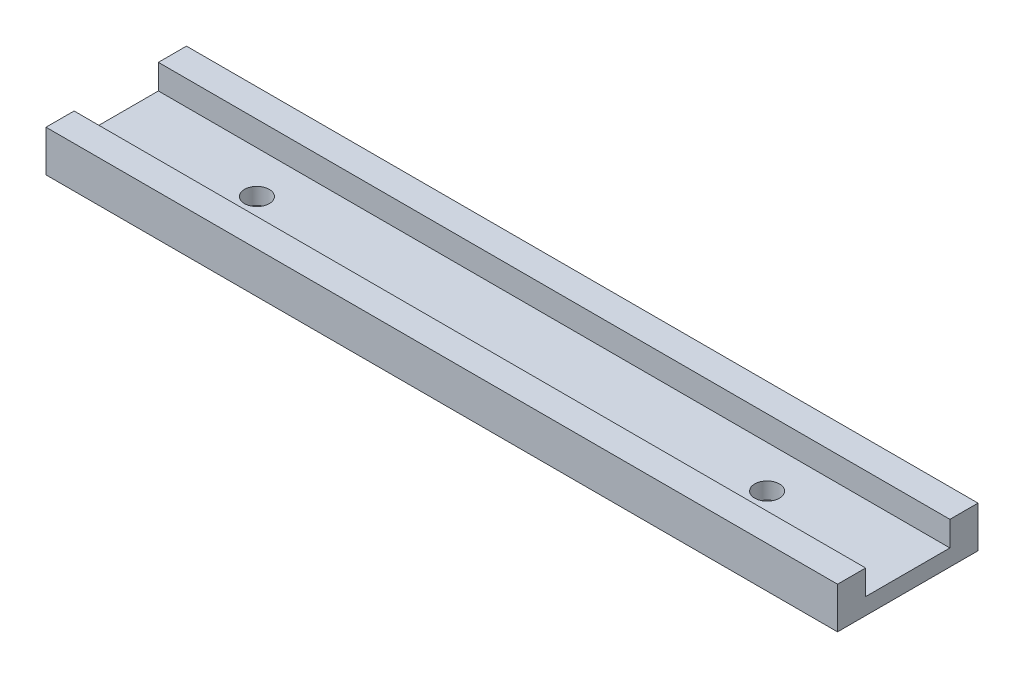
ISO-10303-21;
HEADER;
FILE_DESCRIPTION(('STEP AP214'),'2;1');
FILE_NAME('part.step','',(''),(''),'','','');
FILE_SCHEMA(('AUTOMOTIVE_DESIGN { 1 0 10303 214 1 1 1 1 }'));
ENDSEC;
DATA;
#1=APPLICATION_CONTEXT('core data for automotive mechanical design processes');
#2=APPLICATION_PROTOCOL_DEFINITION('international standard','automotive_design',2000,#1);
#3=PRODUCT_CONTEXT('',#1,'mechanical');
#4=PRODUCT('Part','Part','',(#3));
#5=PRODUCT_RELATED_PRODUCT_CATEGORY('part','',(#4));
#6=PRODUCT_DEFINITION_FORMATION('','',#4);
#7=PRODUCT_DEFINITION_CONTEXT('part definition',#1,'design');
#8=PRODUCT_DEFINITION('design','',#6,#7);
#9=PRODUCT_DEFINITION_SHAPE('','',#8);
#10=(LENGTH_UNIT() NAMED_UNIT(*) SI_UNIT(.MILLI.,.METRE.));
#11=(NAMED_UNIT(*) PLANE_ANGLE_UNIT() SI_UNIT($,.RADIAN.));
#12=(NAMED_UNIT(*) SI_UNIT($,.STERADIAN.) SOLID_ANGLE_UNIT());
#13=UNCERTAINTY_MEASURE_WITH_UNIT(LENGTH_MEASURE(1.E-05),#10,'distance_accuracy_value','');
#14=(GEOMETRIC_REPRESENTATION_CONTEXT(3) GLOBAL_UNCERTAINTY_ASSIGNED_CONTEXT((#13)) GLOBAL_UNIT_ASSIGNED_CONTEXT((#10,
#11,#12)) REPRESENTATION_CONTEXT('',''));
#15=CARTESIAN_POINT('',(0.,0.,0.));
#16=DIRECTION('',(0.,0.,1.));
#17=DIRECTION('',(1.,0.,0.));
#18=AXIS2_PLACEMENT_3D('',#15,#16,#17);
#19=CARTESIAN_POINT('',(47.9,5.,5.1));
#20=DIRECTION('',(0.,-1.,0.));
#21=DIRECTION('',(0.,0.,-1.));
#22=AXIS2_PLACEMENT_3D('',#19,#20,#21);
#23=PLANE('',#22);
#24=DIRECTION('',(0.,0.,1.));
#25=VECTOR('',#24,1.);
#26=CARTESIAN_POINT('',(-47.9,5.,5.1));
#27=LINE('',#26,#25);
#28=CARTESIAN_POINT('',(-47.9,5.,5.1));
#29=VERTEX_POINT('',#28);
#30=CARTESIAN_POINT('',(-47.9,5.,8.5));
#31=VERTEX_POINT('',#30);
#32=EDGE_CURVE('E135',#29,#31,#27,.T.);
#33=ORIENTED_EDGE('',*,*,#32,.T.);
#34=DIRECTION('',(-1.,0.,0.));
#35=VECTOR('',#34,1.);
#36=CARTESIAN_POINT('',(47.9,5.,8.5));
#37=LINE('',#36,#35);
#38=CARTESIAN_POINT('',(47.9,5.,8.5));
#39=VERTEX_POINT('',#38);
#40=EDGE_CURVE('E11',#39,#31,#37,.T.);
#41=ORIENTED_EDGE('',*,*,#40,.F.);
#42=DIRECTION('',(0.,0.,1.));
#43=VECTOR('',#42,1.);
#44=CARTESIAN_POINT('',(47.9,5.,5.1));
#45=LINE('',#44,#43);
#46=CARTESIAN_POINT('',(47.9,5.,5.1));
#47=VERTEX_POINT('',#46);
#48=EDGE_CURVE('E150',#47,#39,#45,.T.);
#49=ORIENTED_EDGE('',*,*,#48,.F.);
#50=DIRECTION('',(-1.,0.,0.));
#51=VECTOR('',#50,1.);
#52=CARTESIAN_POINT('',(47.9,5.,5.1));
#53=LINE('',#52,#51);
#54=EDGE_CURVE('E131',#47,#29,#53,.T.);
#55=ORIENTED_EDGE('',*,*,#54,.T.);
#56=EDGE_LOOP('',(#33,#41,#49,#55));
#57=FACE_BOUND('',#56,.T.);
#58=ADVANCED_FACE('F38',(#57),#23,.F.);
#59=CARTESIAN_POINT('',(47.9,5.,8.5));
#60=DIRECTION('',(0.,0.,-1.));
#61=DIRECTION('',(-1.,0.,0.));
#62=AXIS2_PLACEMENT_3D('',#59,#60,#61);
#63=PLANE('',#62);
#64=DIRECTION('',(0.,-1.,0.));
#65=VECTOR('',#64,1.);
#66=CARTESIAN_POINT('',(-47.9,5.,8.5));
#67=LINE('',#66,#65);
#68=CARTESIAN_POINT('',(-47.9,0.,8.5));
#69=VERTEX_POINT('',#68);
#70=EDGE_CURVE('E138',#31,#69,#67,.T.);
#71=ORIENTED_EDGE('',*,*,#70,.T.);
#72=DIRECTION('',(-1.,0.,0.));
#73=VECTOR('',#72,1.);
#74=CARTESIAN_POINT('',(47.9,0.,8.5));
#75=LINE('',#74,#73);
#76=CARTESIAN_POINT('',(47.9,0.,8.5));
#77=VERTEX_POINT('',#76);
#78=EDGE_CURVE('E47',#77,#69,#75,.T.);
#79=ORIENTED_EDGE('',*,*,#78,.F.);
#80=DIRECTION('',(0.,-1.,0.));
#81=VECTOR('',#80,1.);
#82=CARTESIAN_POINT('',(47.9,5.,8.5));
#83=LINE('',#82,#81);
#84=EDGE_CURVE('E98',#39,#77,#83,.T.);
#85=ORIENTED_EDGE('',*,*,#84,.F.);
#86=ORIENTED_EDGE('',*,*,#40,.T.);
#87=EDGE_LOOP('',(#71,#79,#85,#86));
#88=FACE_BOUND('',#87,.T.);
#89=ADVANCED_FACE('F208',(#88),#63,.F.);
#90=CARTESIAN_POINT('',(47.9,0.,8.5));
#91=DIRECTION('',(0.,1.,0.));
#92=DIRECTION('',(0.,0.,1.));
#93=AXIS2_PLACEMENT_3D('',#90,#91,#92);
#94=PLANE('',#93);
#95=CARTESIAN_POINT('',(-30.875,0.,0.));
#96=DIRECTION('',(0.,1.,0.));
#97=DIRECTION('',(0.,0.,1.));
#98=AXIS2_PLACEMENT_3D('',#95,#96,#97);
#99=CIRCLE('',#98,1.5);
#100=CARTESIAN_POINT('',(-30.875,0.,1.5));
#101=VERTEX_POINT('',#100);
#102=EDGE_CURVE('E41',#101,#101,#99,.T.);
#103=ORIENTED_EDGE('',*,*,#102,.T.);
#104=EDGE_LOOP('',(#103));
#105=FACE_BOUND('',#104,.T.);
#106=CARTESIAN_POINT('',(30.875,0.,0.));
#107=DIRECTION('',(0.,1.,0.));
#108=DIRECTION('',(0.,0.,1.));
#109=AXIS2_PLACEMENT_3D('',#106,#107,#108);
#110=CIRCLE('',#109,1.5);
#111=CARTESIAN_POINT('',(30.875,0.,1.49999999999999));
#112=VERTEX_POINT('',#111);
#113=EDGE_CURVE('E139',#112,#112,#110,.T.);
#114=ORIENTED_EDGE('',*,*,#113,.T.);
#115=EDGE_LOOP('',(#114));
#116=FACE_BOUND('',#115,.T.);
#117=DIRECTION('',(0.,0.,-1.));
#118=VECTOR('',#117,1.);
#119=CARTESIAN_POINT('',(-47.9,0.,8.5));
#120=LINE('',#119,#118);
#121=CARTESIAN_POINT('',(-47.9,0.,-8.5));
#122=VERTEX_POINT('',#121);
#123=EDGE_CURVE('E141',#69,#122,#120,.T.);
#124=ORIENTED_EDGE('',*,*,#123,.T.);
#125=DIRECTION('',(-1.,0.,0.));
#126=VECTOR('',#125,1.);
#127=CARTESIAN_POINT('',(47.9,0.,-8.5));
#128=LINE('',#127,#126);
#129=CARTESIAN_POINT('',(47.9,0.,-8.5));
#130=VERTEX_POINT('',#129);
#131=EDGE_CURVE('E157',#130,#122,#128,.T.);
#132=ORIENTED_EDGE('',*,*,#131,.F.);
#133=DIRECTION('',(0.,0.,-1.));
#134=VECTOR('',#133,1.);
#135=CARTESIAN_POINT('',(47.9,0.,8.5));
#136=LINE('',#135,#134);
#137=EDGE_CURVE('E166',#77,#130,#136,.T.);
#138=ORIENTED_EDGE('',*,*,#137,.F.);
#139=ORIENTED_EDGE('',*,*,#78,.T.);
#140=EDGE_LOOP('',(#124,#132,#138,#139));
#141=FACE_BOUND('',#140,.T.);
#142=ADVANCED_FACE('F164',(#105,#116,#141),#94,.F.);
#143=CARTESIAN_POINT('',(47.9,0.,-8.5));
#144=DIRECTION('',(0.,0.,1.));
#145=DIRECTION('',(1.,0.,0.));
#146=AXIS2_PLACEMENT_3D('',#143,#144,#145);
#147=PLANE('',#146);
#148=DIRECTION('',(0.,1.,0.));
#149=VECTOR('',#148,1.);
#150=CARTESIAN_POINT('',(-47.9,0.,-8.5));
#151=LINE('',#150,#149);
#152=CARTESIAN_POINT('',(-47.9,5.,-8.5));
#153=VERTEX_POINT('',#152);
#154=EDGE_CURVE('E143',#122,#153,#151,.T.);
#155=ORIENTED_EDGE('',*,*,#154,.T.);
#156=DIRECTION('',(-1.,0.,0.));
#157=VECTOR('',#156,1.);
#158=CARTESIAN_POINT('',(47.9,5.,-8.5));
#159=LINE('',#158,#157);
#160=CARTESIAN_POINT('',(47.9,5.,-8.5));
#161=VERTEX_POINT('',#160);
#162=EDGE_CURVE('E154',#161,#153,#159,.T.);
#163=ORIENTED_EDGE('',*,*,#162,.F.);
#164=DIRECTION('',(0.,1.,0.));
#165=VECTOR('',#164,1.);
#166=CARTESIAN_POINT('',(47.9,0.,-8.5));
#167=LINE('',#166,#165);
#168=EDGE_CURVE('E178',#130,#161,#167,.T.);
#169=ORIENTED_EDGE('',*,*,#168,.F.);
#170=ORIENTED_EDGE('',*,*,#131,.T.);
#171=EDGE_LOOP('',(#155,#163,#169,#170));
#172=FACE_BOUND('',#171,.T.);
#173=ADVANCED_FACE('F174',(#172),#147,.F.);
#174=CARTESIAN_POINT('',(47.9,5.,-8.5));
#175=DIRECTION('',(0.,-1.,0.));
#176=DIRECTION('',(0.,0.,-1.));
#177=AXIS2_PLACEMENT_3D('',#174,#175,#176);
#178=PLANE('',#177);
#179=DIRECTION('',(0.,0.,1.));
#180=VECTOR('',#179,1.);
#181=CARTESIAN_POINT('',(-47.9,5.,-8.5));
#182=LINE('',#181,#180);
#183=CARTESIAN_POINT('',(-47.9,5.,-5.1));
#184=VERTEX_POINT('',#183);
#185=EDGE_CURVE('E145',#153,#184,#182,.T.);
#186=ORIENTED_EDGE('',*,*,#185,.T.);
#187=DIRECTION('',(-1.,0.,0.));
#188=VECTOR('',#187,1.);
#189=CARTESIAN_POINT('',(47.9,5.,-5.1));
#190=LINE('',#189,#188);
#191=CARTESIAN_POINT('',(47.9,5.,-5.1));
#192=VERTEX_POINT('',#191);
#193=EDGE_CURVE('E126',#192,#184,#190,.T.);
#194=ORIENTED_EDGE('',*,*,#193,.F.);
#195=DIRECTION('',(0.,0.,1.));
#196=VECTOR('',#195,1.);
#197=CARTESIAN_POINT('',(47.9,5.,-8.5));
#198=LINE('',#197,#196);
#199=EDGE_CURVE('E117',#161,#192,#198,.T.);
#200=ORIENTED_EDGE('',*,*,#199,.F.);
#201=ORIENTED_EDGE('',*,*,#162,.T.);
#202=EDGE_LOOP('',(#186,#194,#200,#201));
#203=FACE_BOUND('',#202,.T.);
#204=ADVANCED_FACE('F177',(#203),#178,.F.);
#205=CARTESIAN_POINT('',(47.9,5.,-5.1));
#206=DIRECTION('',(0.,0.,-1.));
#207=DIRECTION('',(0.,1.,0.));
#208=AXIS2_PLACEMENT_3D('',#205,#206,#207);
#209=PLANE('',#208);
#210=DIRECTION('',(0.,-1.,0.));
#211=VECTOR('',#210,1.);
#212=CARTESIAN_POINT('',(-47.9,5.,-5.1));
#213=LINE('',#212,#211);
#214=CARTESIAN_POINT('',(-47.9,2.,-5.1));
#215=VERTEX_POINT('',#214);
#216=EDGE_CURVE('E125',#184,#215,#213,.T.);
#217=ORIENTED_EDGE('',*,*,#216,.T.);
#218=DIRECTION('',(-1.,0.,0.));
#219=VECTOR('',#218,1.);
#220=CARTESIAN_POINT('',(47.9,2.,-5.1));
#221=LINE('',#220,#219);
#222=CARTESIAN_POINT('',(47.9,2.,-5.1));
#223=VERTEX_POINT('',#222);
#224=EDGE_CURVE('E122',#223,#215,#221,.T.);
#225=ORIENTED_EDGE('',*,*,#224,.F.);
#226=DIRECTION('',(0.,-1.,0.));
#227=VECTOR('',#226,1.);
#228=CARTESIAN_POINT('',(47.9,5.,-5.1));
#229=LINE('',#228,#227);
#230=EDGE_CURVE('E111',#192,#223,#229,.T.);
#231=ORIENTED_EDGE('',*,*,#230,.F.);
#232=ORIENTED_EDGE('',*,*,#193,.T.);
#233=EDGE_LOOP('',(#217,#225,#231,#232));
#234=FACE_BOUND('',#233,.T.);
#235=ADVANCED_FACE('F123',(#234),#209,.F.);
#236=CARTESIAN_POINT('',(47.9,2.,-5.1));
#237=DIRECTION('',(0.,-1.,0.));
#238=DIRECTION('',(0.,0.,-1.));
#239=AXIS2_PLACEMENT_3D('',#236,#237,#238);
#240=PLANE('',#239);
#241=CARTESIAN_POINT('',(-30.875,2.,0.));
#242=DIRECTION('',(0.,1.,0.));
#243=DIRECTION('',(0.,0.,1.));
#244=AXIS2_PLACEMENT_3D('',#241,#242,#243);
#245=CIRCLE('',#244,1.5);
#246=CARTESIAN_POINT('',(-30.875,2.,1.5));
#247=VERTEX_POINT('',#246);
#248=EDGE_CURVE('E189',#247,#247,#245,.T.);
#249=ORIENTED_EDGE('',*,*,#248,.F.);
#250=EDGE_LOOP('',(#249));
#251=FACE_BOUND('',#250,.T.);
#252=CARTESIAN_POINT('',(30.875,2.,0.));
#253=DIRECTION('',(0.,1.,0.));
#254=DIRECTION('',(0.,0.,1.));
#255=AXIS2_PLACEMENT_3D('',#252,#253,#254);
#256=CIRCLE('',#255,1.5);
#257=CARTESIAN_POINT('',(30.875,2.,1.49999999999999));
#258=VERTEX_POINT('',#257);
#259=EDGE_CURVE('E186',#258,#258,#256,.T.);
#260=ORIENTED_EDGE('',*,*,#259,.F.);
#261=EDGE_LOOP('',(#260));
#262=FACE_BOUND('',#261,.T.);
#263=DIRECTION('',(0.,0.,1.));
#264=VECTOR('',#263,1.);
#265=CARTESIAN_POINT('',(-47.9,2.,-5.1));
#266=LINE('',#265,#264);
#267=CARTESIAN_POINT('',(-47.9,2.,5.1));
#268=VERTEX_POINT('',#267);
#269=EDGE_CURVE('E84',#215,#268,#266,.T.);
#270=ORIENTED_EDGE('',*,*,#269,.T.);
#271=DIRECTION('',(-1.,0.,0.));
#272=VECTOR('',#271,1.);
#273=CARTESIAN_POINT('',(47.9,2.,5.1));
#274=LINE('',#273,#272);
#275=CARTESIAN_POINT('',(47.9,2.,5.1));
#276=VERTEX_POINT('',#275);
#277=EDGE_CURVE('E127',#276,#268,#274,.T.);
#278=ORIENTED_EDGE('',*,*,#277,.F.);
#279=DIRECTION('',(0.,0.,1.));
#280=VECTOR('',#279,1.);
#281=CARTESIAN_POINT('',(47.9,2.,-5.1));
#282=LINE('',#281,#280);
#283=EDGE_CURVE('E115',#223,#276,#282,.T.);
#284=ORIENTED_EDGE('',*,*,#283,.F.);
#285=ORIENTED_EDGE('',*,*,#224,.T.);
#286=EDGE_LOOP('',(#270,#278,#284,#285));
#287=FACE_BOUND('',#286,.T.);
#288=ADVANCED_FACE('F129',(#251,#262,#287),#240,.F.);
#289=CARTESIAN_POINT('',(47.9,2.,5.1));
#290=DIRECTION('',(0.,0.,1.));
#291=DIRECTION('',(0.,-1.,0.));
#292=AXIS2_PLACEMENT_3D('',#289,#290,#291);
#293=PLANE('',#292);
#294=DIRECTION('',(0.,1.,0.));
#295=VECTOR('',#294,1.);
#296=CARTESIAN_POINT('',(-47.9,2.,5.1));
#297=LINE('',#296,#295);
#298=EDGE_CURVE('E90',#268,#29,#297,.T.);
#299=ORIENTED_EDGE('',*,*,#298,.T.);
#300=ORIENTED_EDGE('',*,*,#54,.F.);
#301=DIRECTION('',(0.,1.,0.));
#302=VECTOR('',#301,1.);
#303=CARTESIAN_POINT('',(47.9,2.,5.1));
#304=LINE('',#303,#302);
#305=EDGE_CURVE('E55',#276,#47,#304,.T.);
#306=ORIENTED_EDGE('',*,*,#305,.F.);
#307=ORIENTED_EDGE('',*,*,#277,.T.);
#308=EDGE_LOOP('',(#299,#300,#306,#307));
#309=FACE_BOUND('',#308,.T.);
#310=ADVANCED_FACE('F215',(#309),#293,.F.);
#311=CARTESIAN_POINT('',(47.9,0.,0.));
#312=DIRECTION('',(1.,0.,0.));
#313=DIRECTION('',(0.,0.,-1.));
#314=AXIS2_PLACEMENT_3D('',#311,#312,#313);
#315=PLANE('',#314);
#316=ORIENTED_EDGE('',*,*,#48,.T.);
#317=ORIENTED_EDGE('',*,*,#84,.T.);
#318=ORIENTED_EDGE('',*,*,#137,.T.);
#319=ORIENTED_EDGE('',*,*,#168,.T.);
#320=ORIENTED_EDGE('',*,*,#199,.T.);
#321=ORIENTED_EDGE('',*,*,#230,.T.);
#322=ORIENTED_EDGE('',*,*,#283,.T.);
#323=ORIENTED_EDGE('',*,*,#305,.T.);
#324=EDGE_LOOP('',(#316,#317,#318,#319,#320,#321,#322,#323));
#325=FACE_BOUND('',#324,.T.);
#326=ADVANCED_FACE('F113',(#325),#315,.T.);
#327=CARTESIAN_POINT('',(-47.9,0.,0.));
#328=DIRECTION('',(1.,0.,0.));
#329=DIRECTION('',(0.,0.,-1.));
#330=AXIS2_PLACEMENT_3D('',#327,#328,#329);
#331=PLANE('',#330);
#332=ORIENTED_EDGE('',*,*,#32,.F.);
#333=ORIENTED_EDGE('',*,*,#298,.F.);
#334=ORIENTED_EDGE('',*,*,#269,.F.);
#335=ORIENTED_EDGE('',*,*,#216,.F.);
#336=ORIENTED_EDGE('',*,*,#185,.F.);
#337=ORIENTED_EDGE('',*,*,#154,.F.);
#338=ORIENTED_EDGE('',*,*,#123,.F.);
#339=ORIENTED_EDGE('',*,*,#70,.F.);
#340=EDGE_LOOP('',(#332,#333,#334,#335,#336,#337,#338,#339));
#341=FACE_BOUND('',#340,.T.);
#342=ADVANCED_FACE('F170',(#341),#331,.F.);
#343=CARTESIAN_POINT('',(30.875,2.,0.));
#344=DIRECTION('',(0.,1.,0.));
#345=DIRECTION('',(0.,0.,1.));
#346=AXIS2_PLACEMENT_3D('',#343,#344,#345);
#347=CYLINDRICAL_SURFACE('',#346,1.5);
#348=ORIENTED_EDGE('',*,*,#259,.T.);
#349=EDGE_LOOP('',(#348));
#350=FACE_BOUND('',#349,.T.);
#351=ORIENTED_EDGE('',*,*,#113,.F.);
#352=EDGE_LOOP('',(#351));
#353=FACE_BOUND('',#352,.T.);
#354=ADVANCED_FACE('F200',(#350,#353),#347,.F.);
#355=CARTESIAN_POINT('',(-30.875,2.,0.));
#356=DIRECTION('',(0.,1.,0.));
#357=DIRECTION('',(0.,0.,1.));
#358=AXIS2_PLACEMENT_3D('',#355,#356,#357);
#359=CYLINDRICAL_SURFACE('',#358,1.5);
#360=ORIENTED_EDGE('',*,*,#248,.T.);
#361=EDGE_LOOP('',(#360));
#362=FACE_BOUND('',#361,.T.);
#363=ORIENTED_EDGE('',*,*,#102,.F.);
#364=EDGE_LOOP('',(#363));
#365=FACE_BOUND('',#364,.T.);
#366=ADVANCED_FACE('F198',(#362,#365),#359,.F.);
#367=CLOSED_SHELL('',(#58,#89,#142,#173,#204,#235,#288,#310,#326,#342,#354,#366));
#368=MANIFOLD_SOLID_BREP('B2',#367);
#369=ADVANCED_BREP_SHAPE_REPRESENTATION('',(#18,#368),#14);
#370=SHAPE_DEFINITION_REPRESENTATION(#9,#369);
ENDSEC;
END-ISO-10303-21;
